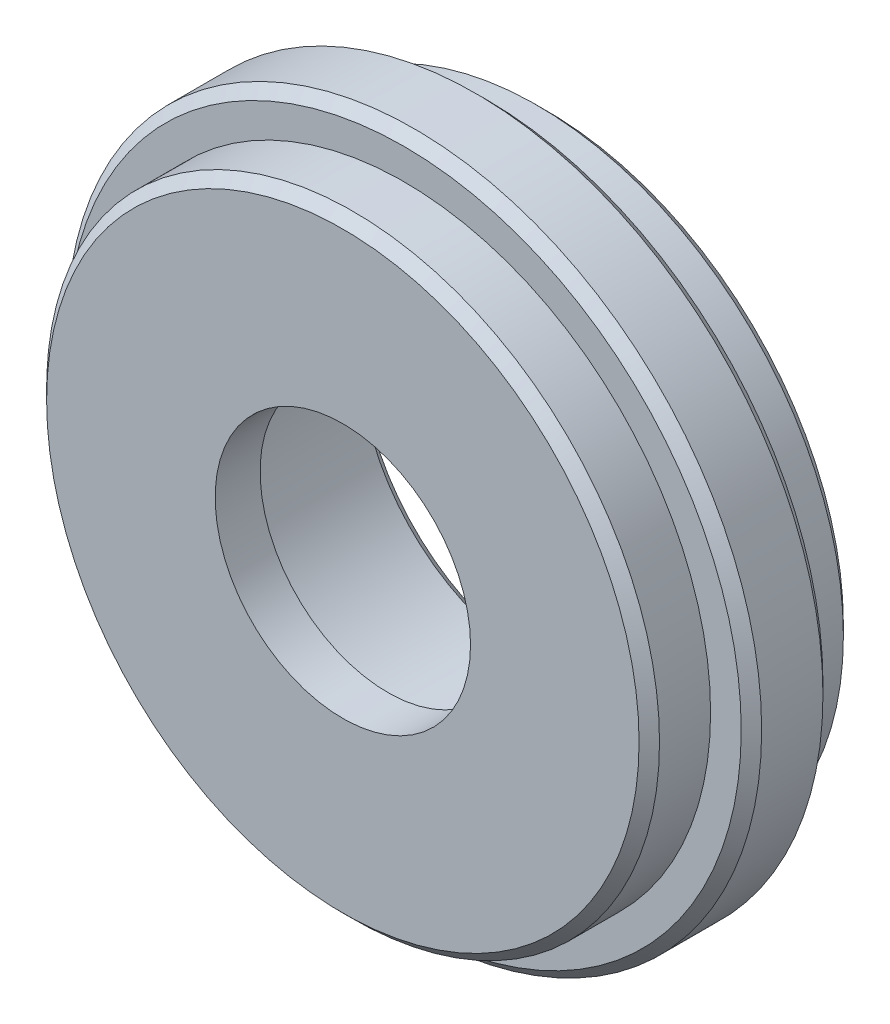
ISO-10303-21;
HEADER;
FILE_DESCRIPTION(('STEP AP214'),'2;1');
FILE_NAME('part.step','',(''),(''),'','','');
FILE_SCHEMA(('AUTOMOTIVE_DESIGN { 1 0 10303 214 1 1 1 1 }'));
ENDSEC;
DATA;
#1=APPLICATION_CONTEXT('core data for automotive mechanical design processes');
#2=APPLICATION_PROTOCOL_DEFINITION('international standard','automotive_design',2000,#1);
#3=PRODUCT_CONTEXT('',#1,'mechanical');
#4=PRODUCT('Part','Part','',(#3));
#5=PRODUCT_RELATED_PRODUCT_CATEGORY('part','',(#4));
#6=PRODUCT_DEFINITION_FORMATION('','',#4);
#7=PRODUCT_DEFINITION_CONTEXT('part definition',#1,'design');
#8=PRODUCT_DEFINITION('design','',#6,#7);
#9=PRODUCT_DEFINITION_SHAPE('','',#8);
#10=(LENGTH_UNIT() NAMED_UNIT(*) SI_UNIT(.MILLI.,.METRE.));
#11=(NAMED_UNIT(*) PLANE_ANGLE_UNIT() SI_UNIT($,.RADIAN.));
#12=(NAMED_UNIT(*) SI_UNIT($,.STERADIAN.) SOLID_ANGLE_UNIT());
#13=UNCERTAINTY_MEASURE_WITH_UNIT(LENGTH_MEASURE(1.E-05),#10,'distance_accuracy_value','');
#14=(GEOMETRIC_REPRESENTATION_CONTEXT(3) GLOBAL_UNCERTAINTY_ASSIGNED_CONTEXT((#13)) GLOBAL_UNIT_ASSIGNED_CONTEXT((#10,
#11,#12)) REPRESENTATION_CONTEXT('',''));
#15=CARTESIAN_POINT('',(0.,0.,0.));
#16=DIRECTION('',(0.,0.,1.));
#17=DIRECTION('',(1.,0.,0.));
#18=AXIS2_PLACEMENT_3D('',#15,#16,#17);
#19=CARTESIAN_POINT('',(0.,0.,6.35));
#20=DIRECTION('',(0.,0.,-1.));
#21=DIRECTION('',(-1.,0.,0.));
#22=AXIS2_PLACEMENT_3D('',#19,#20,#21);
#23=CYLINDRICAL_SURFACE('',#22,10.9873);
#24=CARTESIAN_POINT('',(0.,0.,-5.71500000000001));
#25=DIRECTION('',(0.,0.,1.));
#26=DIRECTION('',(1.,0.,0.));
#27=AXIS2_PLACEMENT_3D('',#24,#25,#26);
#28=CIRCLE('',#27,10.9873);
#29=CARTESIAN_POINT('',(10.9873,0.,-5.71500000000001));
#30=VERTEX_POINT('',#29);
#31=EDGE_CURVE('E10',#30,#30,#28,.F.);
#32=ORIENTED_EDGE('',*,*,#31,.T.);
#33=EDGE_LOOP('',(#32));
#34=FACE_BOUND('',#33,.T.);
#35=CARTESIAN_POINT('',(0.,0.,3.556));
#36=DIRECTION('',(0.,0.,1.));
#37=DIRECTION('',(1.,0.,0.));
#38=AXIS2_PLACEMENT_3D('',#35,#36,#37);
#39=CIRCLE('',#38,10.9873);
#40=CARTESIAN_POINT('',(10.9873,0.,3.556));
#41=VERTEX_POINT('',#40);
#42=EDGE_CURVE('E75',#41,#41,#39,.T.);
#43=ORIENTED_EDGE('',*,*,#42,.T.);
#44=EDGE_LOOP('',(#43));
#45=FACE_BOUND('',#44,.T.);
#46=ADVANCED_FACE('F33',(#34,#45),#23,.F.);
#47=CARTESIAN_POINT('',(0.,0.,6.35));
#48=DIRECTION('',(0.,0.,-1.));
#49=DIRECTION('',(-1.,0.,0.));
#50=AXIS2_PLACEMENT_3D('',#47,#48,#49);
#51=CYLINDRICAL_SURFACE('',#50,19.05);
#52=CARTESIAN_POINT('',(0.,0.,-5.715));
#53=DIRECTION('',(0.,0.,1.));
#54=DIRECTION('',(1.,0.,0.));
#55=AXIS2_PLACEMENT_3D('',#52,#53,#54);
#56=CIRCLE('',#55,19.05);
#57=CARTESIAN_POINT('',(19.05,0.,-5.715));
#58=VERTEX_POINT('',#57);
#59=EDGE_CURVE('E56',#58,#58,#56,.T.);
#60=ORIENTED_EDGE('',*,*,#59,.T.);
#61=EDGE_LOOP('',(#60));
#62=FACE_BOUND('',#61,.T.);
#63=CARTESIAN_POINT('',(0.,0.,-2.54));
#64=DIRECTION('',(0.,0.,1.));
#65=DIRECTION('',(1.,0.,0.));
#66=AXIS2_PLACEMENT_3D('',#63,#64,#65);
#67=CIRCLE('',#66,19.05);
#68=CARTESIAN_POINT('',(19.05,0.,-2.54));
#69=VERTEX_POINT('',#68);
#70=EDGE_CURVE('E71',#69,#69,#67,.T.);
#71=ORIENTED_EDGE('',*,*,#70,.F.);
#72=EDGE_LOOP('',(#71));
#73=FACE_BOUND('',#72,.T.);
#74=ADVANCED_FACE('F100',(#62,#73),#51,.T.);
#75=CARTESIAN_POINT('',(0.,0.,6.35));
#76=DIRECTION('',(0.,0.,1.));
#77=DIRECTION('',(1.,0.,0.));
#78=AXIS2_PLACEMENT_3D('',#75,#76,#77);
#79=PLANE('',#78);
#80=CARTESIAN_POINT('',(0.,0.,6.35));
#81=DIRECTION('',(0.,0.,1.));
#82=DIRECTION('',(1.,0.,0.));
#83=AXIS2_PLACEMENT_3D('',#80,#81,#82);
#84=CIRCLE('',#83,18.415);
#85=CARTESIAN_POINT('',(18.415,0.,6.35));
#86=VERTEX_POINT('',#85);
#87=EDGE_CURVE('E48',#86,#86,#84,.T.);
#88=ORIENTED_EDGE('',*,*,#87,.T.);
#89=EDGE_LOOP('',(#88));
#90=FACE_BOUND('',#89,.T.);
#91=CARTESIAN_POINT('',(0.,0.,6.35));
#92=DIRECTION('',(0.,0.,1.));
#93=DIRECTION('',(1.,0.,0.));
#94=AXIS2_PLACEMENT_3D('',#91,#92,#93);
#95=CIRCLE('',#94,7.9375);
#96=CARTESIAN_POINT('',(7.9375,0.,6.35));
#97=VERTEX_POINT('',#96);
#98=EDGE_CURVE('E81',#97,#97,#95,.T.);
#99=ORIENTED_EDGE('',*,*,#98,.F.);
#100=EDGE_LOOP('',(#99));
#101=FACE_BOUND('',#100,.T.);
#102=ADVANCED_FACE('F97',(#90,#101),#79,.T.);
#103=CARTESIAN_POINT('',(0.,0.,-6.35));
#104=DIRECTION('',(0.,0.,1.));
#105=DIRECTION('',(1.,0.,0.));
#106=AXIS2_PLACEMENT_3D('',#103,#104,#105);
#107=PLANE('',#106);
#108=CARTESIAN_POINT('',(0.,0.,-6.35));
#109=DIRECTION('',(0.,0.,1.));
#110=DIRECTION('',(1.,0.,0.));
#111=AXIS2_PLACEMENT_3D('',#108,#109,#110);
#112=CIRCLE('',#111,11.6223);
#113=CARTESIAN_POINT('',(11.6223,0.,-6.35));
#114=VERTEX_POINT('',#113);
#115=EDGE_CURVE('E40',#114,#114,#112,.T.);
#116=ORIENTED_EDGE('',*,*,#115,.T.);
#117=EDGE_LOOP('',(#116));
#118=FACE_BOUND('',#117,.T.);
#119=CARTESIAN_POINT('',(0.,0.,-6.35));
#120=DIRECTION('',(0.,0.,1.));
#121=DIRECTION('',(1.,0.,0.));
#122=AXIS2_PLACEMENT_3D('',#119,#120,#121);
#123=CIRCLE('',#122,18.415);
#124=CARTESIAN_POINT('',(18.415,0.,-6.35));
#125=VERTEX_POINT('',#124);
#126=EDGE_CURVE('E53',#125,#125,#123,.F.);
#127=ORIENTED_EDGE('',*,*,#126,.T.);
#128=EDGE_LOOP('',(#127));
#129=FACE_BOUND('',#128,.T.);
#130=ADVANCED_FACE('F99',(#118,#129),#107,.F.);
#131=CARTESIAN_POINT('',(0.,0.,5.71499999999999));
#132=DIRECTION('',(0.,0.,1.));
#133=DIRECTION('',(1.,0.,0.));
#134=AXIS2_PLACEMENT_3D('',#131,#132,#133);
#135=CIRCLE('',#134,19.05);
#136=CARTESIAN_POINT('',(19.05,0.,5.71499999999999));
#137=VERTEX_POINT('',#136);
#138=EDGE_CURVE('E44',#137,#137,#135,.F.);
#139=ORIENTED_EDGE('',*,*,#138,.T.);
#140=EDGE_LOOP('',(#139));
#141=FACE_BOUND('',#140,.T.);
#142=CARTESIAN_POINT('',(0.,0.,2.54));
#143=DIRECTION('',(0.,0.,1.));
#144=DIRECTION('',(1.,0.,0.));
#145=AXIS2_PLACEMENT_3D('',#142,#143,#144);
#146=CIRCLE('',#145,19.05);
#147=CARTESIAN_POINT('',(19.05,0.,2.54));
#148=VERTEX_POINT('',#147);
#149=EDGE_CURVE('E72',#148,#148,#146,.T.);
#150=ORIENTED_EDGE('',*,*,#149,.T.);
#151=EDGE_LOOP('',(#150));
#152=FACE_BOUND('',#151,.T.);
#153=ADVANCED_FACE('F107',(#141,#152),#51,.T.);
#154=CARTESIAN_POINT('',(0.,0.,2.54));
#155=DIRECTION('',(0.,0.,1.));
#156=DIRECTION('',(1.,0.,0.));
#157=AXIS2_PLACEMENT_3D('',#154,#155,#156);
#158=PLANE('',#157);
#159=CARTESIAN_POINT('',(0.,0.,2.54));
#160=DIRECTION('',(0.,0.,1.));
#161=DIRECTION('',(1.,0.,0.));
#162=AXIS2_PLACEMENT_3D('',#159,#160,#161);
#163=CIRCLE('',#162,20.955);
#164=CARTESIAN_POINT('',(20.955,0.,2.54));
#165=VERTEX_POINT('',#164);
#166=EDGE_CURVE('E59',#165,#165,#163,.T.);
#167=ORIENTED_EDGE('',*,*,#166,.T.);
#168=EDGE_LOOP('',(#167));
#169=FACE_BOUND('',#168,.T.);
#170=ORIENTED_EDGE('',*,*,#149,.F.);
#171=EDGE_LOOP('',(#170));
#172=FACE_BOUND('',#171,.T.);
#173=ADVANCED_FACE('F124',(#169,#172),#158,.T.);
#174=CARTESIAN_POINT('',(0.,0.,-2.54));
#175=DIRECTION('',(0.,0.,1.));
#176=DIRECTION('',(1.,0.,0.));
#177=AXIS2_PLACEMENT_3D('',#174,#175,#176);
#178=PLANE('',#177);
#179=CARTESIAN_POINT('',(0.,0.,-2.54));
#180=DIRECTION('',(0.,0.,1.));
#181=DIRECTION('',(1.,0.,0.));
#182=AXIS2_PLACEMENT_3D('',#179,#180,#181);
#183=CIRCLE('',#182,20.955);
#184=CARTESIAN_POINT('',(20.955,0.,-2.54));
#185=VERTEX_POINT('',#184);
#186=EDGE_CURVE('E62',#185,#185,#183,.F.);
#187=ORIENTED_EDGE('',*,*,#186,.T.);
#188=EDGE_LOOP('',(#187));
#189=FACE_BOUND('',#188,.T.);
#190=ORIENTED_EDGE('',*,*,#70,.T.);
#191=EDGE_LOOP('',(#190));
#192=FACE_BOUND('',#191,.T.);
#193=ADVANCED_FACE('F120',(#189,#192),#178,.F.);
#194=CARTESIAN_POINT('',(0.,0.,2.54));
#195=DIRECTION('',(0.,0.,-1.));
#196=DIRECTION('',(-1.,0.,0.));
#197=AXIS2_PLACEMENT_3D('',#194,#195,#196);
#198=CYLINDRICAL_SURFACE('',#197,21.59);
#199=CARTESIAN_POINT('',(0.,0.,-1.90500000000001));
#200=DIRECTION('',(0.,0.,1.));
#201=DIRECTION('',(1.,0.,0.));
#202=AXIS2_PLACEMENT_3D('',#199,#200,#201);
#203=CIRCLE('',#202,21.59);
#204=CARTESIAN_POINT('',(21.59,0.,-1.90500000000001));
#205=VERTEX_POINT('',#204);
#206=EDGE_CURVE('E65',#205,#205,#203,.T.);
#207=ORIENTED_EDGE('',*,*,#206,.T.);
#208=EDGE_LOOP('',(#207));
#209=FACE_BOUND('',#208,.T.);
#210=CARTESIAN_POINT('',(0.,0.,1.90500000000001));
#211=DIRECTION('',(0.,0.,1.));
#212=DIRECTION('',(1.,0.,0.));
#213=AXIS2_PLACEMENT_3D('',#210,#211,#212);
#214=CIRCLE('',#213,21.59);
#215=CARTESIAN_POINT('',(21.59,0.,1.90500000000001));
#216=VERTEX_POINT('',#215);
#217=EDGE_CURVE('E68',#216,#216,#214,.F.);
#218=ORIENTED_EDGE('',*,*,#217,.T.);
#219=EDGE_LOOP('',(#218));
#220=FACE_BOUND('',#219,.T.);
#221=ADVANCED_FACE('F117',(#209,#220),#198,.T.);
#222=CARTESIAN_POINT('',(0.,0.,3.556));
#223=DIRECTION('',(0.,0.,1.));
#224=DIRECTION('',(1.,0.,0.));
#225=AXIS2_PLACEMENT_3D('',#222,#223,#224);
#226=PLANE('',#225);
#227=CARTESIAN_POINT('',(0.,0.,3.556));
#228=DIRECTION('',(0.,0.,1.));
#229=DIRECTION('',(1.,0.,0.));
#230=AXIS2_PLACEMENT_3D('',#227,#228,#229);
#231=CIRCLE('',#230,7.9375);
#232=CARTESIAN_POINT('',(7.9375,0.,3.556));
#233=VERTEX_POINT('',#232);
#234=EDGE_CURVE('E80',#233,#233,#231,.T.);
#235=ORIENTED_EDGE('',*,*,#234,.T.);
#236=EDGE_LOOP('',(#235));
#237=FACE_BOUND('',#236,.T.);
#238=ORIENTED_EDGE('',*,*,#42,.F.);
#239=EDGE_LOOP('',(#238));
#240=FACE_BOUND('',#239,.T.);
#241=ADVANCED_FACE('F87',(#237,#240),#226,.F.);
#242=CARTESIAN_POINT('',(0.,0.,3.556));
#243=DIRECTION('',(0.,0.,1.));
#244=DIRECTION('',(1.,0.,0.));
#245=AXIS2_PLACEMENT_3D('',#242,#243,#244);
#246=CYLINDRICAL_SURFACE('',#245,7.9375);
#247=ORIENTED_EDGE('',*,*,#234,.F.);
#248=EDGE_LOOP('',(#247));
#249=FACE_BOUND('',#248,.T.);
#250=ORIENTED_EDGE('',*,*,#98,.T.);
#251=EDGE_LOOP('',(#250));
#252=FACE_BOUND('',#251,.T.);
#253=ADVANCED_FACE('F90',(#249,#252),#246,.F.);
#254=CARTESIAN_POINT('',(0.,0.,-1.90500000000001));
#255=DIRECTION('',(0.,0.,1.));
#256=DIRECTION('',(1.,0.,0.));
#257=AXIS2_PLACEMENT_3D('',#254,#255,#256);
#258=CONICAL_SURFACE('',#257,21.59,0.785398163397448);
#259=ORIENTED_EDGE('',*,*,#186,.F.);
#260=EDGE_LOOP('',(#259));
#261=FACE_BOUND('',#260,.T.);
#262=ORIENTED_EDGE('',*,*,#206,.F.);
#263=EDGE_LOOP('',(#262));
#264=FACE_BOUND('',#263,.T.);
#265=ADVANCED_FACE('F93',(#261,#264),#258,.T.);
#266=CARTESIAN_POINT('',(0.,0.,2.54));
#267=DIRECTION('',(0.,0.,-1.));
#268=DIRECTION('',(-1.,0.,0.));
#269=AXIS2_PLACEMENT_3D('',#266,#267,#268);
#270=CONICAL_SURFACE('',#269,20.955,0.785398163397446);
#271=ORIENTED_EDGE('',*,*,#217,.F.);
#272=EDGE_LOOP('',(#271));
#273=FACE_BOUND('',#272,.T.);
#274=ORIENTED_EDGE('',*,*,#166,.F.);
#275=EDGE_LOOP('',(#274));
#276=FACE_BOUND('',#275,.T.);
#277=ADVANCED_FACE('F145',(#273,#276),#270,.T.);
#278=CARTESIAN_POINT('',(0.,0.,-5.715));
#279=DIRECTION('',(0.,0.,1.));
#280=DIRECTION('',(1.,0.,0.));
#281=AXIS2_PLACEMENT_3D('',#278,#279,#280);
#282=CONICAL_SURFACE('',#281,19.05,0.785398163397451);
#283=ORIENTED_EDGE('',*,*,#126,.F.);
#284=EDGE_LOOP('',(#283));
#285=FACE_BOUND('',#284,.T.);
#286=ORIENTED_EDGE('',*,*,#59,.F.);
#287=EDGE_LOOP('',(#286));
#288=FACE_BOUND('',#287,.T.);
#289=ADVANCED_FACE('F153',(#285,#288),#282,.T.);
#290=CARTESIAN_POINT('',(0.,0.,6.35));
#291=DIRECTION('',(0.,0.,-1.));
#292=DIRECTION('',(-1.,0.,0.));
#293=AXIS2_PLACEMENT_3D('',#290,#291,#292);
#294=CONICAL_SURFACE('',#293,18.415,0.785398163397443);
#295=ORIENTED_EDGE('',*,*,#138,.F.);
#296=EDGE_LOOP('',(#295));
#297=FACE_BOUND('',#296,.T.);
#298=ORIENTED_EDGE('',*,*,#87,.F.);
#299=EDGE_LOOP('',(#298));
#300=FACE_BOUND('',#299,.T.);
#301=ADVANCED_FACE('F161',(#297,#300),#294,.T.);
#302=CARTESIAN_POINT('',(0.,0.,-6.35));
#303=DIRECTION('',(0.,0.,-1.));
#304=DIRECTION('',(-1.,0.,0.));
#305=AXIS2_PLACEMENT_3D('',#302,#303,#304);
#306=CONICAL_SURFACE('',#305,11.6223,0.785398163397443);
#307=ORIENTED_EDGE('',*,*,#31,.F.);
#308=EDGE_LOOP('',(#307));
#309=FACE_BOUND('',#308,.T.);
#310=ORIENTED_EDGE('',*,*,#115,.F.);
#311=EDGE_LOOP('',(#310));
#312=FACE_BOUND('',#311,.T.);
#313=ADVANCED_FACE('F35',(#309,#312),#306,.F.);
#314=CLOSED_SHELL('',(#46,#74,#102,#130,#153,#173,#193,#221,#241,#253,#265,#277,#289,#301,#313));
#315=MANIFOLD_SOLID_BREP('B2',#314);
#316=ADVANCED_BREP_SHAPE_REPRESENTATION('',(#18,#315),#14);
#317=SHAPE_DEFINITION_REPRESENTATION(#9,#316);
ENDSEC;
END-ISO-10303-21;
